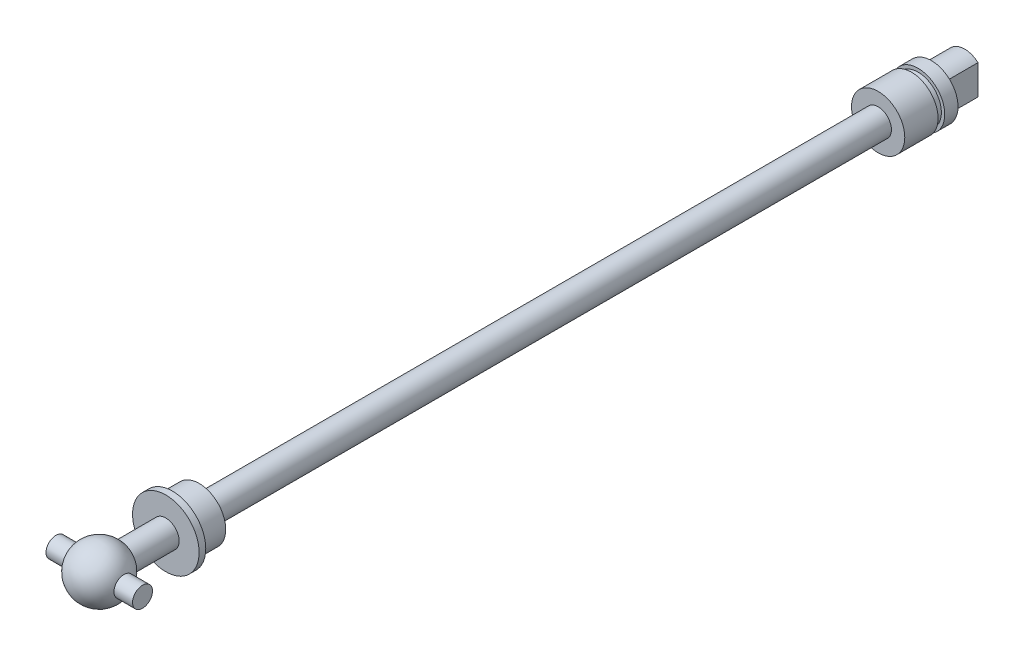
ISO-10303-21;
HEADER;
FILE_DESCRIPTION(('STEP AP214'),'2;1');
FILE_NAME('part.step','',(''),(''),'','','');
FILE_SCHEMA(('AUTOMOTIVE_DESIGN { 1 0 10303 214 1 1 1 1 }'));
ENDSEC;
DATA;
#1=APPLICATION_CONTEXT('core data for automotive mechanical design processes');
#2=APPLICATION_PROTOCOL_DEFINITION('international standard','automotive_design',2000,#1);
#3=PRODUCT_CONTEXT('',#1,'mechanical');
#4=PRODUCT('Part','Part','',(#3));
#5=PRODUCT_RELATED_PRODUCT_CATEGORY('part','',(#4));
#6=PRODUCT_DEFINITION_FORMATION('','',#4);
#7=PRODUCT_DEFINITION_CONTEXT('part definition',#1,'design');
#8=PRODUCT_DEFINITION('design','',#6,#7);
#9=PRODUCT_DEFINITION_SHAPE('','',#8);
#10=(LENGTH_UNIT() NAMED_UNIT(*) SI_UNIT(.MILLI.,.METRE.));
#11=(NAMED_UNIT(*) PLANE_ANGLE_UNIT() SI_UNIT($,.RADIAN.));
#12=(NAMED_UNIT(*) SI_UNIT($,.STERADIAN.) SOLID_ANGLE_UNIT());
#13=UNCERTAINTY_MEASURE_WITH_UNIT(LENGTH_MEASURE(1.E-05),#10,'distance_accuracy_value','');
#14=(GEOMETRIC_REPRESENTATION_CONTEXT(3) GLOBAL_UNCERTAINTY_ASSIGNED_CONTEXT((#13)) GLOBAL_UNIT_ASSIGNED_CONTEXT((#10,
#11,#12)) REPRESENTATION_CONTEXT('',''));
#15=CARTESIAN_POINT('',(0.,0.,0.));
#16=DIRECTION('',(0.,0.,1.));
#17=DIRECTION('',(1.,0.,0.));
#18=AXIS2_PLACEMENT_3D('',#15,#16,#17);
#19=CARTESIAN_POINT('',(0.,0.,-4.));
#20=DIRECTION('',(0.,0.,1.));
#21=DIRECTION('',(0.,1.,0.));
#22=AXIS2_PLACEMENT_3D('',#19,#20,#21);
#23=SPHERICAL_SURFACE('',#22,4.);
#24=CARTESIAN_POINT('',(0.,0.,-7.46410161513776));
#25=DIRECTION('',(0.,0.,1.));
#26=DIRECTION('',(1.,0.,0.));
#27=AXIS2_PLACEMENT_3D('',#24,#25,#26);
#28=CIRCLE('',#27,2.);
#29=CARTESIAN_POINT('',(2.,0.,-7.46410161513776));
#30=VERTEX_POINT('',#29);
#31=EDGE_CURVE('E141',#30,#30,#28,.T.);
#32=ORIENTED_EDGE('',*,*,#31,.T.);
#33=EDGE_LOOP('',(#32));
#34=FACE_BOUND('',#33,.T.);
#35=CARTESIAN_POINT('',(3.70809924354783,0.,-4.));
#36=DIRECTION('',(-1.,0.,0.));
#37=DIRECTION('',(0.,0.,1.));
#38=AXIS2_PLACEMENT_3D('',#35,#36,#37);
#39=CIRCLE('',#38,1.5);
#40=CARTESIAN_POINT('',(3.70809924354783,0.,-2.5));
#41=VERTEX_POINT('',#40);
#42=EDGE_CURVE('E41',#41,#41,#39,.F.);
#43=ORIENTED_EDGE('',*,*,#42,.F.);
#44=EDGE_LOOP('',(#43));
#45=FACE_BOUND('',#44,.T.);
#46=CARTESIAN_POINT('',(-3.70809924354783,0.,-4.));
#47=DIRECTION('',(1.,0.,0.));
#48=DIRECTION('',(0.,0.,-1.));
#49=AXIS2_PLACEMENT_3D('',#46,#47,#48);
#50=CIRCLE('',#49,1.5);
#51=CARTESIAN_POINT('',(-3.70809924354783,0.,-5.5));
#52=VERTEX_POINT('',#51);
#53=EDGE_CURVE('E11',#52,#52,#50,.F.);
#54=ORIENTED_EDGE('',*,*,#53,.F.);
#55=EDGE_LOOP('',(#54));
#56=FACE_BOUND('',#55,.T.);
#57=ADVANCED_FACE('F34',(#34,#45,#56),#23,.T.);
#58=CARTESIAN_POINT('',(0.,3.,-134.));
#59=DIRECTION('',(0.,0.,1.));
#60=DIRECTION('',(1.,0.,0.));
#61=AXIS2_PLACEMENT_3D('',#58,#59,#60);
#62=PLANE('',#61);
#63=CARTESIAN_POINT('',(0.,0.,-134.));
#64=DIRECTION('',(0.,0.,1.));
#65=DIRECTION('',(1.,0.,0.));
#66=AXIS2_PLACEMENT_3D('',#63,#64,#65);
#67=CIRCLE('',#66,3.);
#68=CARTESIAN_POINT('',(2.,2.23606797749979,-134.));
#69=VERTEX_POINT('',#68);
#70=CARTESIAN_POINT('',(-2.,2.23606797749979,-134.));
#71=VERTEX_POINT('',#70);
#72=EDGE_CURVE('E91',#69,#71,#67,.T.);
#73=ORIENTED_EDGE('',*,*,#72,.F.);
#74=DIRECTION('',(0.,1.,0.));
#75=VECTOR('',#74,1.);
#76=CARTESIAN_POINT('',(2.,0.,-134.));
#77=LINE('',#76,#75);
#78=CARTESIAN_POINT('',(2.,-2.23606797749979,-134.));
#79=VERTEX_POINT('',#78);
#80=EDGE_CURVE('E74',#79,#69,#77,.T.);
#81=ORIENTED_EDGE('',*,*,#80,.F.);
#82=CARTESIAN_POINT('',(-2.,-2.23606797749979,-134.));
#83=VERTEX_POINT('',#82);
#84=EDGE_CURVE('E96',#83,#79,#67,.T.);
#85=ORIENTED_EDGE('',*,*,#84,.F.);
#86=DIRECTION('',(0.,1.,0.));
#87=VECTOR('',#86,1.);
#88=CARTESIAN_POINT('',(-2.,0.,-134.));
#89=LINE('',#88,#87);
#90=EDGE_CURVE('E85',#83,#71,#89,.T.);
#91=ORIENTED_EDGE('',*,*,#90,.T.);
#92=EDGE_LOOP('',(#73,#81,#85,#91));
#93=FACE_BOUND('',#92,.T.);
#94=ADVANCED_FACE('F95',(#93),#62,.F.);
#95=CARTESIAN_POINT('',(0.,0.,0.));
#96=DIRECTION('',(0.,0.,1.));
#97=DIRECTION('',(1.,0.,0.));
#98=AXIS2_PLACEMENT_3D('',#95,#96,#97);
#99=CYLINDRICAL_SURFACE('',#98,3.);
#100=ORIENTED_EDGE('',*,*,#84,.T.);
#101=DIRECTION('',(0.,0.,-1.));
#102=VECTOR('',#101,1.);
#103=CARTESIAN_POINT('',(2.,-2.23606797749979,-124.417424305044));
#104=LINE('',#103,#102);
#105=CARTESIAN_POINT('',(2.,-2.23606797749979,-129.));
#106=VERTEX_POINT('',#105);
#107=EDGE_CURVE('E80',#106,#79,#104,.T.);
#108=ORIENTED_EDGE('',*,*,#107,.F.);
#109=CARTESIAN_POINT('',(0.,0.,-129.));
#110=DIRECTION('',(0.,0.,1.));
#111=DIRECTION('',(1.,0.,0.));
#112=AXIS2_PLACEMENT_3D('',#109,#110,#111);
#113=CIRCLE('',#112,3.);
#114=CARTESIAN_POINT('',(-2.,-2.23606797749979,-129.));
#115=VERTEX_POINT('',#114);
#116=EDGE_CURVE('E101',#115,#106,#113,.T.);
#117=ORIENTED_EDGE('',*,*,#116,.F.);
#118=DIRECTION('',(0.,0.,-1.));
#119=VECTOR('',#118,1.);
#120=CARTESIAN_POINT('',(-2.,-2.23606797749979,-124.417424305044));
#121=LINE('',#120,#119);
#122=EDGE_CURVE('E48',#115,#83,#121,.T.);
#123=ORIENTED_EDGE('',*,*,#122,.T.);
#124=EDGE_LOOP('',(#100,#108,#117,#123));
#125=FACE_BOUND('',#124,.T.);
#126=ADVANCED_FACE('F244',(#125),#99,.T.);
#127=CARTESIAN_POINT('',(2.,2.23606797749979,-129.));
#128=VERTEX_POINT('',#127);
#129=CARTESIAN_POINT('',(-2.,2.23606797749979,-129.));
#130=VERTEX_POINT('',#129);
#131=EDGE_CURVE('E92',#128,#130,#113,.T.);
#132=ORIENTED_EDGE('',*,*,#131,.F.);
#133=DIRECTION('',(0.,0.,-1.));
#134=VECTOR('',#133,1.);
#135=CARTESIAN_POINT('',(2.,2.23606797749979,-124.417424305044));
#136=LINE('',#135,#134);
#137=EDGE_CURVE('E77',#128,#69,#136,.T.);
#138=ORIENTED_EDGE('',*,*,#137,.T.);
#139=ORIENTED_EDGE('',*,*,#72,.T.);
#140=DIRECTION('',(0.,0.,-1.));
#141=VECTOR('',#140,1.);
#142=CARTESIAN_POINT('',(-2.,2.23606797749979,-124.417424305044));
#143=LINE('',#142,#141);
#144=EDGE_CURVE('E145',#130,#71,#143,.T.);
#145=ORIENTED_EDGE('',*,*,#144,.F.);
#146=EDGE_LOOP('',(#132,#138,#139,#145));
#147=FACE_BOUND('',#146,.T.);
#148=ADVANCED_FACE('F89',(#147),#99,.T.);
#149=CARTESIAN_POINT('',(0.,4.,-129.));
#150=DIRECTION('',(0.,0.,1.));
#151=DIRECTION('',(1.,0.,0.));
#152=AXIS2_PLACEMENT_3D('',#149,#150,#151);
#153=PLANE('',#152);
#154=CARTESIAN_POINT('',(0.,0.,-129.));
#155=DIRECTION('',(0.,0.,1.));
#156=DIRECTION('',(1.,0.,0.));
#157=AXIS2_PLACEMENT_3D('',#154,#155,#156);
#158=CIRCLE('',#157,4.);
#159=CARTESIAN_POINT('',(4.,0.,-129.));
#160=VERTEX_POINT('',#159);
#161=EDGE_CURVE('E102',#160,#160,#158,.T.);
#162=ORIENTED_EDGE('',*,*,#161,.F.);
#163=EDGE_LOOP('',(#162));
#164=FACE_BOUND('',#163,.T.);
#165=ORIENTED_EDGE('',*,*,#131,.T.);
#166=DIRECTION('',(0.,1.,0.));
#167=VECTOR('',#166,1.);
#168=CARTESIAN_POINT('',(-2.,0.,-129.));
#169=LINE('',#168,#167);
#170=EDGE_CURVE('E147',#115,#130,#169,.T.);
#171=ORIENTED_EDGE('',*,*,#170,.F.);
#172=ORIENTED_EDGE('',*,*,#116,.T.);
#173=DIRECTION('',(0.,1.,0.));
#174=VECTOR('',#173,1.);
#175=CARTESIAN_POINT('',(2.,0.,-129.));
#176=LINE('',#175,#174);
#177=EDGE_CURVE('E56',#106,#128,#176,.T.);
#178=ORIENTED_EDGE('',*,*,#177,.T.);
#179=EDGE_LOOP('',(#165,#171,#172,#178));
#180=FACE_BOUND('',#179,.T.);
#181=ADVANCED_FACE('F239',(#164,#180),#153,.F.);
#182=CARTESIAN_POINT('',(0.,0.,0.));
#183=DIRECTION('',(0.,0.,1.));
#184=DIRECTION('',(1.,0.,0.));
#185=AXIS2_PLACEMENT_3D('',#182,#183,#184);
#186=CYLINDRICAL_SURFACE('',#185,4.);
#187=CARTESIAN_POINT('',(0.,0.,-127.));
#188=DIRECTION('',(0.,0.,1.));
#189=DIRECTION('',(1.,0.,0.));
#190=AXIS2_PLACEMENT_3D('',#187,#188,#189);
#191=CIRCLE('',#190,4.);
#192=CARTESIAN_POINT('',(4.,0.,-127.));
#193=VERTEX_POINT('',#192);
#194=EDGE_CURVE('E105',#193,#193,#191,.T.);
#195=ORIENTED_EDGE('',*,*,#194,.F.);
#196=EDGE_LOOP('',(#195));
#197=FACE_BOUND('',#196,.T.);
#198=ORIENTED_EDGE('',*,*,#161,.T.);
#199=EDGE_LOOP('',(#198));
#200=FACE_BOUND('',#199,.T.);
#201=ADVANCED_FACE('F235',(#197,#200),#186,.T.);
#202=CARTESIAN_POINT('',(0.,3.5,-127.));
#203=DIRECTION('',(0.,0.,-1.));
#204=DIRECTION('',(-1.,0.,0.));
#205=AXIS2_PLACEMENT_3D('',#202,#203,#204);
#206=PLANE('',#205);
#207=CARTESIAN_POINT('',(0.,0.,-127.));
#208=DIRECTION('',(0.,0.,1.));
#209=DIRECTION('',(1.,0.,0.));
#210=AXIS2_PLACEMENT_3D('',#207,#208,#209);
#211=CIRCLE('',#210,3.5);
#212=CARTESIAN_POINT('',(3.5,0.,-127.));
#213=VERTEX_POINT('',#212);
#214=EDGE_CURVE('E108',#213,#213,#211,.T.);
#215=ORIENTED_EDGE('',*,*,#214,.F.);
#216=EDGE_LOOP('',(#215));
#217=FACE_BOUND('',#216,.T.);
#218=ORIENTED_EDGE('',*,*,#194,.T.);
#219=EDGE_LOOP('',(#218));
#220=FACE_BOUND('',#219,.T.);
#221=ADVANCED_FACE('F231',(#217,#220),#206,.F.);
#222=CARTESIAN_POINT('',(0.,0.,0.));
#223=DIRECTION('',(0.,0.,1.));
#224=DIRECTION('',(1.,0.,0.));
#225=AXIS2_PLACEMENT_3D('',#222,#223,#224);
#226=CYLINDRICAL_SURFACE('',#225,3.5);
#227=CARTESIAN_POINT('',(0.,0.,-126.));
#228=DIRECTION('',(0.,0.,1.));
#229=DIRECTION('',(1.,0.,0.));
#230=AXIS2_PLACEMENT_3D('',#227,#228,#229);
#231=CIRCLE('',#230,3.5);
#232=CARTESIAN_POINT('',(3.5,0.,-126.));
#233=VERTEX_POINT('',#232);
#234=EDGE_CURVE('E111',#233,#233,#231,.T.);
#235=ORIENTED_EDGE('',*,*,#234,.F.);
#236=EDGE_LOOP('',(#235));
#237=FACE_BOUND('',#236,.T.);
#238=ORIENTED_EDGE('',*,*,#214,.T.);
#239=EDGE_LOOP('',(#238));
#240=FACE_BOUND('',#239,.T.);
#241=ADVANCED_FACE('F227',(#237,#240),#226,.T.);
#242=CARTESIAN_POINT('',(0.,4.,-126.));
#243=DIRECTION('',(0.,0.,1.));
#244=DIRECTION('',(1.,0.,0.));
#245=AXIS2_PLACEMENT_3D('',#242,#243,#244);
#246=PLANE('',#245);
#247=CARTESIAN_POINT('',(0.,0.,-126.));
#248=DIRECTION('',(0.,0.,1.));
#249=DIRECTION('',(1.,0.,0.));
#250=AXIS2_PLACEMENT_3D('',#247,#248,#249);
#251=CIRCLE('',#250,4.);
#252=CARTESIAN_POINT('',(4.,0.,-126.));
#253=VERTEX_POINT('',#252);
#254=EDGE_CURVE('E114',#253,#253,#251,.T.);
#255=ORIENTED_EDGE('',*,*,#254,.F.);
#256=EDGE_LOOP('',(#255));
#257=FACE_BOUND('',#256,.T.);
#258=ORIENTED_EDGE('',*,*,#234,.T.);
#259=EDGE_LOOP('',(#258));
#260=FACE_BOUND('',#259,.T.);
#261=ADVANCED_FACE('F223',(#257,#260),#246,.F.);
#262=CARTESIAN_POINT('',(0.,0.,0.));
#263=DIRECTION('',(0.,0.,1.));
#264=DIRECTION('',(1.,0.,0.));
#265=AXIS2_PLACEMENT_3D('',#262,#263,#264);
#266=CYLINDRICAL_SURFACE('',#265,4.);
#267=CARTESIAN_POINT('',(0.,0.,-121.));
#268=DIRECTION('',(0.,0.,1.));
#269=DIRECTION('',(1.,0.,0.));
#270=AXIS2_PLACEMENT_3D('',#267,#268,#269);
#271=CIRCLE('',#270,4.);
#272=CARTESIAN_POINT('',(4.,0.,-121.));
#273=VERTEX_POINT('',#272);
#274=EDGE_CURVE('E117',#273,#273,#271,.T.);
#275=ORIENTED_EDGE('',*,*,#274,.F.);
#276=EDGE_LOOP('',(#275));
#277=FACE_BOUND('',#276,.T.);
#278=ORIENTED_EDGE('',*,*,#254,.T.);
#279=EDGE_LOOP('',(#278));
#280=FACE_BOUND('',#279,.T.);
#281=ADVANCED_FACE('F219',(#277,#280),#266,.T.);
#282=CARTESIAN_POINT('',(0.,2.,-121.));
#283=DIRECTION('',(0.,0.,-1.));
#284=DIRECTION('',(-1.,0.,0.));
#285=AXIS2_PLACEMENT_3D('',#282,#283,#284);
#286=PLANE('',#285);
#287=CARTESIAN_POINT('',(0.,0.,-121.));
#288=DIRECTION('',(0.,0.,1.));
#289=DIRECTION('',(1.,0.,0.));
#290=AXIS2_PLACEMENT_3D('',#287,#288,#289);
#291=CIRCLE('',#290,2.);
#292=CARTESIAN_POINT('',(2.,0.,-121.));
#293=VERTEX_POINT('',#292);
#294=EDGE_CURVE('E120',#293,#293,#291,.T.);
#295=ORIENTED_EDGE('',*,*,#294,.F.);
#296=EDGE_LOOP('',(#295));
#297=FACE_BOUND('',#296,.T.);
#298=ORIENTED_EDGE('',*,*,#274,.T.);
#299=EDGE_LOOP('',(#298));
#300=FACE_BOUND('',#299,.T.);
#301=ADVANCED_FACE('F215',(#297,#300),#286,.F.);
#302=CARTESIAN_POINT('',(0.,0.,0.));
#303=DIRECTION('',(0.,0.,1.));
#304=DIRECTION('',(1.,0.,0.));
#305=AXIS2_PLACEMENT_3D('',#302,#303,#304);
#306=CYLINDRICAL_SURFACE('',#305,2.);
#307=CARTESIAN_POINT('',(0.,0.,-19.));
#308=DIRECTION('',(0.,0.,1.));
#309=DIRECTION('',(1.,0.,0.));
#310=AXIS2_PLACEMENT_3D('',#307,#308,#309);
#311=CIRCLE('',#310,2.);
#312=CARTESIAN_POINT('',(2.,0.,-19.));
#313=VERTEX_POINT('',#312);
#314=EDGE_CURVE('E123',#313,#313,#311,.T.);
#315=ORIENTED_EDGE('',*,*,#314,.F.);
#316=EDGE_LOOP('',(#315));
#317=FACE_BOUND('',#316,.T.);
#318=ORIENTED_EDGE('',*,*,#294,.T.);
#319=EDGE_LOOP('',(#318));
#320=FACE_BOUND('',#319,.T.);
#321=ADVANCED_FACE('F211',(#317,#320),#306,.T.);
#322=CARTESIAN_POINT('',(0.,4.,-19.));
#323=DIRECTION('',(0.,0.,1.));
#324=DIRECTION('',(1.,0.,0.));
#325=AXIS2_PLACEMENT_3D('',#322,#323,#324);
#326=PLANE('',#325);
#327=CARTESIAN_POINT('',(0.,0.,-19.));
#328=DIRECTION('',(0.,0.,1.));
#329=DIRECTION('',(1.,0.,0.));
#330=AXIS2_PLACEMENT_3D('',#327,#328,#329);
#331=CIRCLE('',#330,4.);
#332=CARTESIAN_POINT('',(4.,0.,-19.));
#333=VERTEX_POINT('',#332);
#334=EDGE_CURVE('E126',#333,#333,#331,.T.);
#335=ORIENTED_EDGE('',*,*,#334,.F.);
#336=EDGE_LOOP('',(#335));
#337=FACE_BOUND('',#336,.T.);
#338=ORIENTED_EDGE('',*,*,#314,.T.);
#339=EDGE_LOOP('',(#338));
#340=FACE_BOUND('',#339,.T.);
#341=ADVANCED_FACE('F207',(#337,#340),#326,.F.);
#342=CARTESIAN_POINT('',(0.,0.,0.));
#343=DIRECTION('',(0.,0.,1.));
#344=DIRECTION('',(1.,0.,0.));
#345=AXIS2_PLACEMENT_3D('',#342,#343,#344);
#346=CYLINDRICAL_SURFACE('',#345,4.);
#347=CARTESIAN_POINT('',(0.,0.,-15.));
#348=DIRECTION('',(0.,0.,1.));
#349=DIRECTION('',(1.,0.,0.));
#350=AXIS2_PLACEMENT_3D('',#347,#348,#349);
#351=CIRCLE('',#350,4.);
#352=CARTESIAN_POINT('',(4.,0.,-15.));
#353=VERTEX_POINT('',#352);
#354=EDGE_CURVE('E129',#353,#353,#351,.T.);
#355=ORIENTED_EDGE('',*,*,#354,.F.);
#356=EDGE_LOOP('',(#355));
#357=FACE_BOUND('',#356,.T.);
#358=ORIENTED_EDGE('',*,*,#334,.T.);
#359=EDGE_LOOP('',(#358));
#360=FACE_BOUND('',#359,.T.);
#361=ADVANCED_FACE('F203',(#357,#360),#346,.T.);
#362=CARTESIAN_POINT('',(0.,5.,-15.));
#363=DIRECTION('',(0.,0.,1.));
#364=DIRECTION('',(1.,0.,0.));
#365=AXIS2_PLACEMENT_3D('',#362,#363,#364);
#366=PLANE('',#365);
#367=CARTESIAN_POINT('',(0.,0.,-15.));
#368=DIRECTION('',(0.,0.,1.));
#369=DIRECTION('',(1.,0.,0.));
#370=AXIS2_PLACEMENT_3D('',#367,#368,#369);
#371=CIRCLE('',#370,5.);
#372=CARTESIAN_POINT('',(5.,0.,-15.));
#373=VERTEX_POINT('',#372);
#374=EDGE_CURVE('E132',#373,#373,#371,.T.);
#375=ORIENTED_EDGE('',*,*,#374,.F.);
#376=EDGE_LOOP('',(#375));
#377=FACE_BOUND('',#376,.T.);
#378=ORIENTED_EDGE('',*,*,#354,.T.);
#379=EDGE_LOOP('',(#378));
#380=FACE_BOUND('',#379,.T.);
#381=ADVANCED_FACE('F199',(#377,#380),#366,.F.);
#382=CARTESIAN_POINT('',(0.,0.,0.));
#383=DIRECTION('',(0.,0.,1.));
#384=DIRECTION('',(1.,0.,0.));
#385=AXIS2_PLACEMENT_3D('',#382,#383,#384);
#386=CYLINDRICAL_SURFACE('',#385,5.);
#387=CARTESIAN_POINT('',(0.,0.,-14.));
#388=DIRECTION('',(0.,0.,1.));
#389=DIRECTION('',(1.,0.,0.));
#390=AXIS2_PLACEMENT_3D('',#387,#388,#389);
#391=CIRCLE('',#390,5.);
#392=CARTESIAN_POINT('',(5.,0.,-14.));
#393=VERTEX_POINT('',#392);
#394=EDGE_CURVE('E135',#393,#393,#391,.T.);
#395=ORIENTED_EDGE('',*,*,#394,.F.);
#396=EDGE_LOOP('',(#395));
#397=FACE_BOUND('',#396,.T.);
#398=ORIENTED_EDGE('',*,*,#374,.T.);
#399=EDGE_LOOP('',(#398));
#400=FACE_BOUND('',#399,.T.);
#401=ADVANCED_FACE('F195',(#397,#400),#386,.T.);
#402=CARTESIAN_POINT('',(0.,2.,-14.));
#403=DIRECTION('',(0.,0.,-1.));
#404=DIRECTION('',(-1.,0.,0.));
#405=AXIS2_PLACEMENT_3D('',#402,#403,#404);
#406=PLANE('',#405);
#407=CARTESIAN_POINT('',(0.,0.,-14.));
#408=DIRECTION('',(0.,0.,1.));
#409=DIRECTION('',(1.,0.,0.));
#410=AXIS2_PLACEMENT_3D('',#407,#408,#409);
#411=CIRCLE('',#410,2.);
#412=CARTESIAN_POINT('',(2.,0.,-14.));
#413=VERTEX_POINT('',#412);
#414=EDGE_CURVE('E138',#413,#413,#411,.T.);
#415=ORIENTED_EDGE('',*,*,#414,.F.);
#416=EDGE_LOOP('',(#415));
#417=FACE_BOUND('',#416,.T.);
#418=ORIENTED_EDGE('',*,*,#394,.T.);
#419=EDGE_LOOP('',(#418));
#420=FACE_BOUND('',#419,.T.);
#421=ADVANCED_FACE('F191',(#417,#420),#406,.F.);
#422=CARTESIAN_POINT('',(0.,0.,0.));
#423=DIRECTION('',(0.,0.,1.));
#424=DIRECTION('',(1.,0.,0.));
#425=AXIS2_PLACEMENT_3D('',#422,#423,#424);
#426=CYLINDRICAL_SURFACE('',#425,2.);
#427=ORIENTED_EDGE('',*,*,#31,.F.);
#428=EDGE_LOOP('',(#427));
#429=FACE_BOUND('',#428,.T.);
#430=ORIENTED_EDGE('',*,*,#414,.T.);
#431=EDGE_LOOP('',(#430));
#432=FACE_BOUND('',#431,.T.);
#433=ADVANCED_FACE('F188',(#429,#432),#426,.T.);
#434=CARTESIAN_POINT('',(-2.,0.,-124.417424305044));
#435=DIRECTION('',(-1.,0.,0.));
#436=DIRECTION('',(0.,-1.,0.));
#437=AXIS2_PLACEMENT_3D('',#434,#435,#436);
#438=PLANE('',#437);
#439=ORIENTED_EDGE('',*,*,#170,.T.);
#440=ORIENTED_EDGE('',*,*,#144,.T.);
#441=ORIENTED_EDGE('',*,*,#90,.F.);
#442=ORIENTED_EDGE('',*,*,#122,.F.);
#443=EDGE_LOOP('',(#439,#440,#441,#442));
#444=FACE_BOUND('',#443,.T.);
#445=ADVANCED_FACE('F185',(#444),#438,.T.);
#446=CARTESIAN_POINT('',(2.,0.,-124.417424305044));
#447=DIRECTION('',(-1.,0.,0.));
#448=DIRECTION('',(0.,-1.,0.));
#449=AXIS2_PLACEMENT_3D('',#446,#447,#448);
#450=PLANE('',#449);
#451=ORIENTED_EDGE('',*,*,#107,.T.);
#452=ORIENTED_EDGE('',*,*,#80,.T.);
#453=ORIENTED_EDGE('',*,*,#137,.F.);
#454=ORIENTED_EDGE('',*,*,#177,.F.);
#455=EDGE_LOOP('',(#451,#452,#453,#454));
#456=FACE_BOUND('',#455,.T.);
#457=ADVANCED_FACE('F76',(#456),#450,.F.);
#458=CARTESIAN_POINT('',(6.5,0.,0.));
#459=DIRECTION('',(1.,0.,0.));
#460=DIRECTION('',(0.,0.,-1.));
#461=AXIS2_PLACEMENT_3D('',#458,#459,#460);
#462=PLANE('',#461);
#463=CARTESIAN_POINT('',(6.5,0.,-4.));
#464=DIRECTION('',(1.,0.,0.));
#465=DIRECTION('',(0.,0.,-1.));
#466=AXIS2_PLACEMENT_3D('',#463,#464,#465);
#467=CIRCLE('',#466,1.5);
#468=CARTESIAN_POINT('',(6.5,0.,-5.5));
#469=VERTEX_POINT('',#468);
#470=EDGE_CURVE('E149',#469,#469,#467,.T.);
#471=ORIENTED_EDGE('',*,*,#470,.T.);
#472=EDGE_LOOP('',(#471));
#473=FACE_BOUND('',#472,.T.);
#474=ADVANCED_FACE('F159',(#473),#462,.T.);
#475=CARTESIAN_POINT('',(6.5,0.,-4.));
#476=DIRECTION('',(-1.,0.,0.));
#477=DIRECTION('',(0.,0.,1.));
#478=AXIS2_PLACEMENT_3D('',#475,#476,#477);
#479=CYLINDRICAL_SURFACE('',#478,1.5);
#480=ORIENTED_EDGE('',*,*,#470,.F.);
#481=EDGE_LOOP('',(#480));
#482=FACE_BOUND('',#481,.T.);
#483=ORIENTED_EDGE('',*,*,#42,.T.);
#484=EDGE_LOOP('',(#483));
#485=FACE_BOUND('',#484,.T.);
#486=ADVANCED_FACE('F161',(#482,#485),#479,.T.);
#487=CARTESIAN_POINT('',(-6.5,0.,-4.));
#488=DIRECTION('',(1.,0.,0.));
#489=DIRECTION('',(0.,0.,-1.));
#490=AXIS2_PLACEMENT_3D('',#487,#488,#489);
#491=CIRCLE('',#490,1.5);
#492=CARTESIAN_POINT('',(-6.5,0.,-5.5));
#493=VERTEX_POINT('',#492);
#494=EDGE_CURVE('E153',#493,#493,#491,.T.);
#495=ORIENTED_EDGE('',*,*,#494,.T.);
#496=EDGE_LOOP('',(#495));
#497=FACE_BOUND('',#496,.T.);
#498=ORIENTED_EDGE('',*,*,#53,.T.);
#499=EDGE_LOOP('',(#498));
#500=FACE_BOUND('',#499,.T.);
#501=ADVANCED_FACE('F164',(#497,#500),#479,.T.);
#502=CARTESIAN_POINT('',(-6.5,0.,0.));
#503=DIRECTION('',(1.,0.,0.));
#504=DIRECTION('',(0.,0.,-1.));
#505=AXIS2_PLACEMENT_3D('',#502,#503,#504);
#506=PLANE('',#505);
#507=ORIENTED_EDGE('',*,*,#494,.F.);
#508=EDGE_LOOP('',(#507));
#509=FACE_BOUND('',#508,.T.);
#510=ADVANCED_FACE('F174',(#509),#506,.F.);
#511=CLOSED_SHELL('',(#57,#94,#126,#148,#181,#201,#221,#241,#261,#281,#301,#321,#341,#361,#381,
#401,#421,#433,#445,#457,#474,#486,#501,#510));
#512=MANIFOLD_SOLID_BREP('B2',#511);
#513=ADVANCED_BREP_SHAPE_REPRESENTATION('',(#18,#512),#14);
#514=SHAPE_DEFINITION_REPRESENTATION(#9,#513);
ENDSEC;
END-ISO-10303-21;
